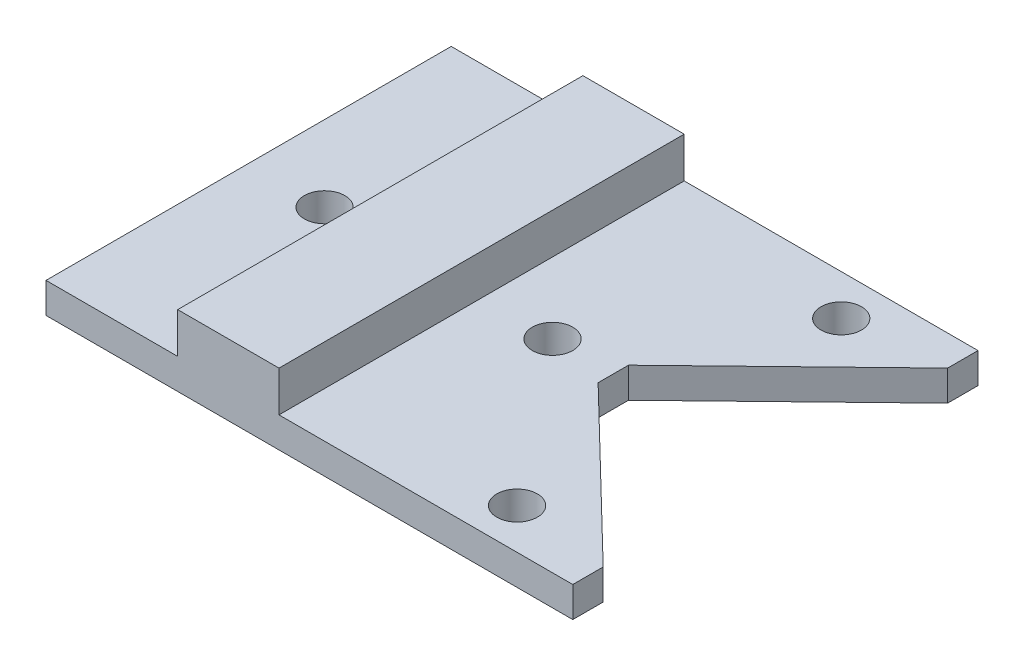
ISO-10303-21;
HEADER;
FILE_DESCRIPTION(('STEP AP214'),'2;1');
FILE_NAME('part.step','',(''),(''),'','','');
FILE_SCHEMA(('AUTOMOTIVE_DESIGN { 1 0 10303 214 1 1 1 1 }'));
ENDSEC;
DATA;
#1=APPLICATION_CONTEXT('core data for automotive mechanical design processes');
#2=APPLICATION_PROTOCOL_DEFINITION('international standard','automotive_design',2000,#1);
#3=PRODUCT_CONTEXT('',#1,'mechanical');
#4=PRODUCT('Part','Part','',(#3));
#5=PRODUCT_RELATED_PRODUCT_CATEGORY('part','',(#4));
#6=PRODUCT_DEFINITION_FORMATION('','',#4);
#7=PRODUCT_DEFINITION_CONTEXT('part definition',#1,'design');
#8=PRODUCT_DEFINITION('design','',#6,#7);
#9=PRODUCT_DEFINITION_SHAPE('','',#8);
#10=(LENGTH_UNIT() NAMED_UNIT(*) SI_UNIT(.MILLI.,.METRE.));
#11=(NAMED_UNIT(*) PLANE_ANGLE_UNIT() SI_UNIT($,.RADIAN.));
#12=(NAMED_UNIT(*) SI_UNIT($,.STERADIAN.) SOLID_ANGLE_UNIT());
#13=UNCERTAINTY_MEASURE_WITH_UNIT(LENGTH_MEASURE(1.E-05),#10,'distance_accuracy_value','');
#14=(GEOMETRIC_REPRESENTATION_CONTEXT(3) GLOBAL_UNCERTAINTY_ASSIGNED_CONTEXT((#13)) GLOBAL_UNIT_ASSIGNED_CONTEXT((#10,
#11,#12)) REPRESENTATION_CONTEXT('',''));
#15=CARTESIAN_POINT('',(0.,0.,0.));
#16=DIRECTION('',(0.,0.,1.));
#17=DIRECTION('',(1.,0.,0.));
#18=AXIS2_PLACEMENT_3D('',#15,#16,#17);
#19=CARTESIAN_POINT('',(0.,3.,0.));
#20=DIRECTION('',(0.,1.,0.));
#21=DIRECTION('',(0.,0.,1.));
#22=AXIS2_PLACEMENT_3D('',#19,#20,#21);
#23=PLANE('',#22);
#24=CARTESIAN_POINT('',(4.,3.,0.));
#25=DIRECTION('',(0.,1.,0.));
#26=DIRECTION('',(0.,0.,1.));
#27=AXIS2_PLACEMENT_3D('',#24,#25,#26);
#28=CIRCLE('',#27,2.);
#29=CARTESIAN_POINT('',(4.,3.,2.));
#30=VERTEX_POINT('',#29);
#31=EDGE_CURVE('E252',#30,#30,#28,.T.);
#32=ORIENTED_EDGE('',*,*,#31,.F.);
#33=EDGE_LOOP('',(#32));
#34=FACE_BOUND('',#33,.T.);
#35=CARTESIAN_POINT('',(16.5,3.,-16.));
#36=DIRECTION('',(0.,1.,0.));
#37=DIRECTION('',(0.,0.,1.));
#38=AXIS2_PLACEMENT_3D('',#35,#36,#37);
#39=CIRCLE('',#38,2.);
#40=CARTESIAN_POINT('',(16.5,3.,-14.));
#41=VERTEX_POINT('',#40);
#42=EDGE_CURVE('E248',#41,#41,#39,.T.);
#43=ORIENTED_EDGE('',*,*,#42,.F.);
#44=EDGE_LOOP('',(#43));
#45=FACE_BOUND('',#44,.T.);
#46=CARTESIAN_POINT('',(16.5,3.,16.));
#47=DIRECTION('',(0.,1.,0.));
#48=DIRECTION('',(0.,0.,1.));
#49=AXIS2_PLACEMENT_3D('',#46,#47,#48);
#50=CIRCLE('',#49,2.);
#51=CARTESIAN_POINT('',(16.5,3.,18.));
#52=VERTEX_POINT('',#51);
#53=EDGE_CURVE('E244',#52,#52,#50,.T.);
#54=ORIENTED_EDGE('',*,*,#53,.F.);
#55=EDGE_LOOP('',(#54));
#56=FACE_BOUND('',#55,.T.);
#57=DIRECTION('',(0.,0.,-1.));
#58=VECTOR('',#57,1.);
#59=CARTESIAN_POINT('',(-3.,3.,20.));
#60=LINE('',#59,#58);
#61=CARTESIAN_POINT('',(-3.,3.,20.));
#62=VERTEX_POINT('',#61);
#63=CARTESIAN_POINT('',(-3.,3.,-20.));
#64=VERTEX_POINT('',#63);
#65=EDGE_CURVE('E154',#62,#64,#60,.T.);
#66=ORIENTED_EDGE('',*,*,#65,.F.);
#67=DIRECTION('',(1.,0.,0.));
#68=VECTOR('',#67,1.);
#69=CARTESIAN_POINT('',(26.,3.,20.));
#70=LINE('',#69,#68);
#71=CARTESIAN_POINT('',(26.,3.,20.));
#72=VERTEX_POINT('',#71);
#73=EDGE_CURVE('E171',#62,#72,#70,.T.);
#74=ORIENTED_EDGE('',*,*,#73,.T.);
#75=DIRECTION('',(0.,0.,-1.));
#76=VECTOR('',#75,1.);
#77=CARTESIAN_POINT('',(26.,3.,20.));
#78=LINE('',#77,#76);
#79=CARTESIAN_POINT('',(26.,3.,17.));
#80=VERTEX_POINT('',#79);
#81=EDGE_CURVE('E176',#72,#80,#78,.T.);
#82=ORIENTED_EDGE('',*,*,#81,.T.);
#83=DIRECTION('',(-0.718240222789173,0.,-0.695795215827012));
#84=VECTOR('',#83,1.);
#85=CARTESIAN_POINT('',(10.,3.,1.5));
#86=LINE('',#85,#84);
#87=CARTESIAN_POINT('',(10.,3.,1.5));
#88=VERTEX_POINT('',#87);
#89=EDGE_CURVE('E179',#80,#88,#86,.T.);
#90=ORIENTED_EDGE('',*,*,#89,.T.);
#91=DIRECTION('',(0.,0.,-1.));
#92=VECTOR('',#91,1.);
#93=CARTESIAN_POINT('',(10.,3.,1.5));
#94=LINE('',#93,#92);
#95=CARTESIAN_POINT('',(10.,3.,-1.5));
#96=VERTEX_POINT('',#95);
#97=EDGE_CURVE('E182',#88,#96,#94,.T.);
#98=ORIENTED_EDGE('',*,*,#97,.T.);
#99=DIRECTION('',(0.718240222789174,0.,-0.695795215827012));
#100=VECTOR('',#99,1.);
#101=CARTESIAN_POINT('',(26.,3.,-17.));
#102=LINE('',#101,#100);
#103=CARTESIAN_POINT('',(26.,3.,-17.));
#104=VERTEX_POINT('',#103);
#105=EDGE_CURVE('E185',#96,#104,#102,.T.);
#106=ORIENTED_EDGE('',*,*,#105,.T.);
#107=DIRECTION('',(0.,0.,-1.));
#108=VECTOR('',#107,1.);
#109=CARTESIAN_POINT('',(26.,3.,-20.));
#110=LINE('',#109,#108);
#111=CARTESIAN_POINT('',(26.,3.,-20.));
#112=VERTEX_POINT('',#111);
#113=EDGE_CURVE('E188',#104,#112,#110,.T.);
#114=ORIENTED_EDGE('',*,*,#113,.T.);
#115=DIRECTION('',(-1.,0.,0.));
#116=VECTOR('',#115,1.);
#117=CARTESIAN_POINT('',(26.,3.,-20.));
#118=LINE('',#117,#116);
#119=EDGE_CURVE('E65',#112,#64,#118,.T.);
#120=ORIENTED_EDGE('',*,*,#119,.T.);
#121=EDGE_LOOP('',(#66,#74,#82,#90,#98,#106,#114,#120));
#122=FACE_BOUND('',#121,.T.);
#123=ADVANCED_FACE('F39',(#34,#45,#56,#122),#23,.T.);
#124=CARTESIAN_POINT('',(-26.,3.,20.));
#125=DIRECTION('',(1.,0.,0.));
#126=DIRECTION('',(0.,0.,-1.));
#127=AXIS2_PLACEMENT_3D('',#124,#125,#126);
#128=PLANE('',#127);
#129=DIRECTION('',(0.,0.,1.));
#130=VECTOR('',#129,1.);
#131=CARTESIAN_POINT('',(-26.,0.,20.));
#132=LINE('',#131,#130);
#133=CARTESIAN_POINT('',(-26.,0.,-20.));
#134=VERTEX_POINT('',#133);
#135=CARTESIAN_POINT('',(-26.,0.,20.));
#136=VERTEX_POINT('',#135);
#137=EDGE_CURVE('E156',#134,#136,#132,.T.);
#138=ORIENTED_EDGE('',*,*,#137,.T.);
#139=DIRECTION('',(0.,-1.,0.));
#140=VECTOR('',#139,1.);
#141=CARTESIAN_POINT('',(-26.,3.,20.));
#142=LINE('',#141,#140);
#143=CARTESIAN_POINT('',(-26.,3.,20.));
#144=VERTEX_POINT('',#143);
#145=EDGE_CURVE('E11',#144,#136,#142,.T.);
#146=ORIENTED_EDGE('',*,*,#145,.F.);
#147=DIRECTION('',(0.,0.,1.));
#148=VECTOR('',#147,1.);
#149=CARTESIAN_POINT('',(-26.,3.,20.));
#150=LINE('',#149,#148);
#151=CARTESIAN_POINT('',(-26.,3.,-20.));
#152=VERTEX_POINT('',#151);
#153=EDGE_CURVE('E167',#152,#144,#150,.T.);
#154=ORIENTED_EDGE('',*,*,#153,.F.);
#155=DIRECTION('',(0.,-1.,0.));
#156=VECTOR('',#155,1.);
#157=CARTESIAN_POINT('',(-26.,3.,-20.));
#158=LINE('',#157,#156);
#159=EDGE_CURVE('E193',#152,#134,#158,.T.);
#160=ORIENTED_EDGE('',*,*,#159,.T.);
#161=EDGE_LOOP('',(#138,#146,#154,#160));
#162=FACE_BOUND('',#161,.T.);
#163=ADVANCED_FACE('F41',(#162),#128,.F.);
#164=CARTESIAN_POINT('',(26.,3.,20.));
#165=DIRECTION('',(0.,0.,-1.));
#166=DIRECTION('',(-1.,0.,0.));
#167=AXIS2_PLACEMENT_3D('',#164,#165,#166);
#168=PLANE('',#167);
#169=DIRECTION('',(1.,0.,0.));
#170=VECTOR('',#169,1.);
#171=CARTESIAN_POINT('',(26.,0.,20.));
#172=LINE('',#171,#170);
#173=CARTESIAN_POINT('',(26.,0.,20.));
#174=VERTEX_POINT('',#173);
#175=EDGE_CURVE('E161',#136,#174,#172,.T.);
#176=ORIENTED_EDGE('',*,*,#175,.T.);
#177=DIRECTION('',(0.,-1.,0.));
#178=VECTOR('',#177,1.);
#179=CARTESIAN_POINT('',(26.,3.,20.));
#180=LINE('',#179,#178);
#181=EDGE_CURVE('E49',#72,#174,#180,.T.);
#182=ORIENTED_EDGE('',*,*,#181,.F.);
#183=ORIENTED_EDGE('',*,*,#73,.F.);
#184=DIRECTION('',(0.,-1.,0.));
#185=VECTOR('',#184,1.);
#186=CARTESIAN_POINT('',(-3.,7.,20.));
#187=LINE('',#186,#185);
#188=CARTESIAN_POINT('',(-3.,7.,20.));
#189=VERTEX_POINT('',#188);
#190=EDGE_CURVE('E273',#189,#62,#187,.T.);
#191=ORIENTED_EDGE('',*,*,#190,.F.);
#192=DIRECTION('',(1.,0.,0.));
#193=VECTOR('',#192,1.);
#194=CARTESIAN_POINT('',(-3.,7.,20.));
#195=LINE('',#194,#193);
#196=CARTESIAN_POINT('',(-13.,7.,20.));
#197=VERTEX_POINT('',#196);
#198=EDGE_CURVE('E147',#197,#189,#195,.T.);
#199=ORIENTED_EDGE('',*,*,#198,.F.);
#200=DIRECTION('',(0.,-1.,0.));
#201=VECTOR('',#200,1.);
#202=CARTESIAN_POINT('',(-13.,7.,20.));
#203=LINE('',#202,#201);
#204=CARTESIAN_POINT('',(-13.,3.,20.));
#205=VERTEX_POINT('',#204);
#206=EDGE_CURVE('E163',#197,#205,#203,.T.);
#207=ORIENTED_EDGE('',*,*,#206,.T.);
#208=EDGE_CURVE('E173',#144,#205,#70,.T.);
#209=ORIENTED_EDGE('',*,*,#208,.F.);
#210=ORIENTED_EDGE('',*,*,#145,.T.);
#211=EDGE_LOOP('',(#176,#182,#183,#191,#199,#207,#209,#210));
#212=FACE_BOUND('',#211,.T.);
#213=ADVANCED_FACE('F283',(#212),#168,.F.);
#214=CARTESIAN_POINT('',(26.,3.,20.));
#215=DIRECTION('',(-1.,0.,0.));
#216=DIRECTION('',(0.,0.,1.));
#217=AXIS2_PLACEMENT_3D('',#214,#215,#216);
#218=PLANE('',#217);
#219=DIRECTION('',(0.,0.,-1.));
#220=VECTOR('',#219,1.);
#221=CARTESIAN_POINT('',(26.,0.,20.));
#222=LINE('',#221,#220);
#223=CARTESIAN_POINT('',(26.,0.,17.));
#224=VERTEX_POINT('',#223);
#225=EDGE_CURVE('E197',#174,#224,#222,.T.);
#226=ORIENTED_EDGE('',*,*,#225,.T.);
#227=DIRECTION('',(0.,-1.,0.));
#228=VECTOR('',#227,1.);
#229=CARTESIAN_POINT('',(26.,3.,17.));
#230=LINE('',#229,#228);
#231=EDGE_CURVE('E233',#80,#224,#230,.T.);
#232=ORIENTED_EDGE('',*,*,#231,.F.);
#233=ORIENTED_EDGE('',*,*,#81,.F.);
#234=ORIENTED_EDGE('',*,*,#181,.T.);
#235=EDGE_LOOP('',(#226,#232,#233,#234));
#236=FACE_BOUND('',#235,.T.);
#237=ADVANCED_FACE('F358',(#236),#218,.F.);
#238=CARTESIAN_POINT('',(10.,3.,1.5));
#239=DIRECTION('',(-0.695795215827012,0.,0.718240222789174));
#240=DIRECTION('',(0.718240222789174,0.,0.695795215827012));
#241=AXIS2_PLACEMENT_3D('',#238,#239,#240);
#242=PLANE('',#241);
#243=DIRECTION('',(-0.718240222789173,0.,-0.695795215827012));
#244=VECTOR('',#243,1.);
#245=CARTESIAN_POINT('',(10.,0.,1.5));
#246=LINE('',#245,#244);
#247=CARTESIAN_POINT('',(10.,0.,1.5));
#248=VERTEX_POINT('',#247);
#249=EDGE_CURVE('E200',#224,#248,#246,.T.);
#250=ORIENTED_EDGE('',*,*,#249,.T.);
#251=DIRECTION('',(0.,-1.,0.));
#252=VECTOR('',#251,1.);
#253=CARTESIAN_POINT('',(10.,3.,1.5));
#254=LINE('',#253,#252);
#255=EDGE_CURVE('E229',#88,#248,#254,.T.);
#256=ORIENTED_EDGE('',*,*,#255,.F.);
#257=ORIENTED_EDGE('',*,*,#89,.F.);
#258=ORIENTED_EDGE('',*,*,#231,.T.);
#259=EDGE_LOOP('',(#250,#256,#257,#258));
#260=FACE_BOUND('',#259,.T.);
#261=ADVANCED_FACE('F355',(#260),#242,.F.);
#262=CARTESIAN_POINT('',(10.,3.,1.5));
#263=DIRECTION('',(-1.,0.,0.));
#264=DIRECTION('',(0.,0.,1.));
#265=AXIS2_PLACEMENT_3D('',#262,#263,#264);
#266=PLANE('',#265);
#267=DIRECTION('',(0.,0.,-1.));
#268=VECTOR('',#267,1.);
#269=CARTESIAN_POINT('',(10.,0.,1.5));
#270=LINE('',#269,#268);
#271=CARTESIAN_POINT('',(10.,0.,-1.5));
#272=VERTEX_POINT('',#271);
#273=EDGE_CURVE('E203',#248,#272,#270,.T.);
#274=ORIENTED_EDGE('',*,*,#273,.T.);
#275=DIRECTION('',(0.,-1.,0.));
#276=VECTOR('',#275,1.);
#277=CARTESIAN_POINT('',(10.,3.,-1.5));
#278=LINE('',#277,#276);
#279=EDGE_CURVE('E225',#96,#272,#278,.T.);
#280=ORIENTED_EDGE('',*,*,#279,.F.);
#281=ORIENTED_EDGE('',*,*,#97,.F.);
#282=ORIENTED_EDGE('',*,*,#255,.T.);
#283=EDGE_LOOP('',(#274,#280,#281,#282));
#284=FACE_BOUND('',#283,.T.);
#285=ADVANCED_FACE('F351',(#284),#266,.F.);
#286=CARTESIAN_POINT('',(26.,3.,-17.));
#287=DIRECTION('',(-0.695795215827012,0.,-0.718240222789174));
#288=DIRECTION('',(-0.718240222789174,0.,0.695795215827012));
#289=AXIS2_PLACEMENT_3D('',#286,#287,#288);
#290=PLANE('',#289);
#291=DIRECTION('',(0.718240222789174,0.,-0.695795215827012));
#292=VECTOR('',#291,1.);
#293=CARTESIAN_POINT('',(26.,0.,-17.));
#294=LINE('',#293,#292);
#295=CARTESIAN_POINT('',(26.,0.,-17.));
#296=VERTEX_POINT('',#295);
#297=EDGE_CURVE('E206',#272,#296,#294,.T.);
#298=ORIENTED_EDGE('',*,*,#297,.T.);
#299=DIRECTION('',(0.,-1.,0.));
#300=VECTOR('',#299,1.);
#301=CARTESIAN_POINT('',(26.,3.,-17.));
#302=LINE('',#301,#300);
#303=EDGE_CURVE('E221',#104,#296,#302,.T.);
#304=ORIENTED_EDGE('',*,*,#303,.F.);
#305=ORIENTED_EDGE('',*,*,#105,.F.);
#306=ORIENTED_EDGE('',*,*,#279,.T.);
#307=EDGE_LOOP('',(#298,#304,#305,#306));
#308=FACE_BOUND('',#307,.T.);
#309=ADVANCED_FACE('F346',(#308),#290,.F.);
#310=CARTESIAN_POINT('',(26.,3.,-20.));
#311=DIRECTION('',(-1.,0.,0.));
#312=DIRECTION('',(0.,0.,1.));
#313=AXIS2_PLACEMENT_3D('',#310,#311,#312);
#314=PLANE('',#313);
#315=DIRECTION('',(0.,0.,-1.));
#316=VECTOR('',#315,1.);
#317=CARTESIAN_POINT('',(26.,0.,-20.));
#318=LINE('',#317,#316);
#319=CARTESIAN_POINT('',(26.,0.,-20.));
#320=VERTEX_POINT('',#319);
#321=EDGE_CURVE('E209',#296,#320,#318,.T.);
#322=ORIENTED_EDGE('',*,*,#321,.T.);
#323=DIRECTION('',(0.,-1.,0.));
#324=VECTOR('',#323,1.);
#325=CARTESIAN_POINT('',(26.,3.,-20.));
#326=LINE('',#325,#324);
#327=EDGE_CURVE('E217',#112,#320,#326,.T.);
#328=ORIENTED_EDGE('',*,*,#327,.F.);
#329=ORIENTED_EDGE('',*,*,#113,.F.);
#330=ORIENTED_EDGE('',*,*,#303,.T.);
#331=EDGE_LOOP('',(#322,#328,#329,#330));
#332=FACE_BOUND('',#331,.T.);
#333=ADVANCED_FACE('F314',(#332),#314,.F.);
#334=CARTESIAN_POINT('',(26.,3.,-20.));
#335=DIRECTION('',(0.,0.,1.));
#336=DIRECTION('',(1.,0.,0.));
#337=AXIS2_PLACEMENT_3D('',#334,#335,#336);
#338=PLANE('',#337);
#339=DIRECTION('',(-1.,0.,0.));
#340=VECTOR('',#339,1.);
#341=CARTESIAN_POINT('',(26.,0.,-20.));
#342=LINE('',#341,#340);
#343=EDGE_CURVE('E172',#320,#134,#342,.T.);
#344=ORIENTED_EDGE('',*,*,#343,.T.);
#345=ORIENTED_EDGE('',*,*,#159,.F.);
#346=CARTESIAN_POINT('',(-13.,3.,-20.));
#347=VERTEX_POINT('',#346);
#348=EDGE_CURVE('E191',#347,#152,#118,.T.);
#349=ORIENTED_EDGE('',*,*,#348,.F.);
#350=DIRECTION('',(0.,-1.,0.));
#351=VECTOR('',#350,1.);
#352=CARTESIAN_POINT('',(-13.,7.,-20.));
#353=LINE('',#352,#351);
#354=CARTESIAN_POINT('',(-13.,7.,-20.));
#355=VERTEX_POINT('',#354);
#356=EDGE_CURVE('E137',#355,#347,#353,.T.);
#357=ORIENTED_EDGE('',*,*,#356,.F.);
#358=DIRECTION('',(-1.,0.,0.));
#359=VECTOR('',#358,1.);
#360=CARTESIAN_POINT('',(-2.99999999999999,7.,-20.));
#361=LINE('',#360,#359);
#362=CARTESIAN_POINT('',(-2.99999999999999,7.,-20.));
#363=VERTEX_POINT('',#362);
#364=EDGE_CURVE('E130',#363,#355,#361,.T.);
#365=ORIENTED_EDGE('',*,*,#364,.F.);
#366=DIRECTION('',(0.,-1.,0.));
#367=VECTOR('',#366,1.);
#368=CARTESIAN_POINT('',(-2.99999999999999,7.,-20.));
#369=LINE('',#368,#367);
#370=EDGE_CURVE('E134',#363,#64,#369,.T.);
#371=ORIENTED_EDGE('',*,*,#370,.T.);
#372=ORIENTED_EDGE('',*,*,#119,.F.);
#373=ORIENTED_EDGE('',*,*,#327,.T.);
#374=EDGE_LOOP('',(#344,#345,#349,#357,#365,#371,#372,#373));
#375=FACE_BOUND('',#374,.T.);
#376=ADVANCED_FACE('F132',(#375),#338,.F.);
#377=CARTESIAN_POINT('',(-18.5,3.,0.));
#378=DIRECTION('',(0.,1.,0.));
#379=DIRECTION('',(0.,0.,1.));
#380=AXIS2_PLACEMENT_3D('',#377,#378,#379);
#381=CIRCLE('',#380,2.);
#382=CARTESIAN_POINT('',(-18.5,3.,2.));
#383=VERTEX_POINT('',#382);
#384=EDGE_CURVE('E265',#383,#383,#381,.T.);
#385=ORIENTED_EDGE('',*,*,#384,.F.);
#386=EDGE_LOOP('',(#385));
#387=FACE_BOUND('',#386,.T.);
#388=DIRECTION('',(0.,0.,1.));
#389=VECTOR('',#388,1.);
#390=CARTESIAN_POINT('',(-13.,3.,20.));
#391=LINE('',#390,#389);
#392=EDGE_CURVE('E57',#347,#205,#391,.T.);
#393=ORIENTED_EDGE('',*,*,#392,.F.);
#394=ORIENTED_EDGE('',*,*,#348,.T.);
#395=ORIENTED_EDGE('',*,*,#153,.T.);
#396=ORIENTED_EDGE('',*,*,#208,.T.);
#397=EDGE_LOOP('',(#393,#394,#395,#396));
#398=FACE_BOUND('',#397,.T.);
#399=ADVANCED_FACE('F299',(#387,#398),#23,.T.);
#400=CARTESIAN_POINT('',(0.,0.,0.));
#401=DIRECTION('',(0.,1.,0.));
#402=DIRECTION('',(0.,0.,1.));
#403=AXIS2_PLACEMENT_3D('',#400,#401,#402);
#404=PLANE('',#403);
#405=CARTESIAN_POINT('',(-18.5,0.,0.));
#406=DIRECTION('',(0.,1.,0.));
#407=DIRECTION('',(0.,0.,1.));
#408=AXIS2_PLACEMENT_3D('',#405,#406,#407);
#409=CIRCLE('',#408,2.);
#410=CARTESIAN_POINT('',(-18.5,0.,2.));
#411=VERTEX_POINT('',#410);
#412=EDGE_CURVE('E43',#411,#411,#409,.T.);
#413=ORIENTED_EDGE('',*,*,#412,.T.);
#414=EDGE_LOOP('',(#413));
#415=FACE_BOUND('',#414,.T.);
#416=CARTESIAN_POINT('',(4.,0.,0.));
#417=DIRECTION('',(0.,1.,0.));
#418=DIRECTION('',(0.,0.,1.));
#419=AXIS2_PLACEMENT_3D('',#416,#417,#418);
#420=CIRCLE('',#419,2.);
#421=CARTESIAN_POINT('',(4.,0.,2.));
#422=VERTEX_POINT('',#421);
#423=EDGE_CURVE('E249',#422,#422,#420,.T.);
#424=ORIENTED_EDGE('',*,*,#423,.T.);
#425=EDGE_LOOP('',(#424));
#426=FACE_BOUND('',#425,.T.);
#427=CARTESIAN_POINT('',(16.5,0.,-16.));
#428=DIRECTION('',(0.,1.,0.));
#429=DIRECTION('',(0.,0.,1.));
#430=AXIS2_PLACEMENT_3D('',#427,#428,#429);
#431=CIRCLE('',#430,2.);
#432=CARTESIAN_POINT('',(16.5,0.,-14.));
#433=VERTEX_POINT('',#432);
#434=EDGE_CURVE('E245',#433,#433,#431,.T.);
#435=ORIENTED_EDGE('',*,*,#434,.T.);
#436=EDGE_LOOP('',(#435));
#437=FACE_BOUND('',#436,.T.);
#438=CARTESIAN_POINT('',(16.5,0.,16.));
#439=DIRECTION('',(0.,1.,0.));
#440=DIRECTION('',(0.,0.,1.));
#441=AXIS2_PLACEMENT_3D('',#438,#439,#440);
#442=CIRCLE('',#441,2.);
#443=CARTESIAN_POINT('',(16.5,0.,18.));
#444=VERTEX_POINT('',#443);
#445=EDGE_CURVE('E240',#444,#444,#442,.T.);
#446=ORIENTED_EDGE('',*,*,#445,.T.);
#447=EDGE_LOOP('',(#446));
#448=FACE_BOUND('',#447,.T.);
#449=ORIENTED_EDGE('',*,*,#137,.F.);
#450=ORIENTED_EDGE('',*,*,#343,.F.);
#451=ORIENTED_EDGE('',*,*,#321,.F.);
#452=ORIENTED_EDGE('',*,*,#297,.F.);
#453=ORIENTED_EDGE('',*,*,#273,.F.);
#454=ORIENTED_EDGE('',*,*,#249,.F.);
#455=ORIENTED_EDGE('',*,*,#225,.F.);
#456=ORIENTED_EDGE('',*,*,#175,.F.);
#457=EDGE_LOOP('',(#449,#450,#451,#452,#453,#454,#455,#456));
#458=FACE_BOUND('',#457,.T.);
#459=ADVANCED_FACE('F294',(#415,#426,#437,#448,#458),#404,.F.);
#460=CARTESIAN_POINT('',(-3.,7.,20.));
#461=DIRECTION('',(-1.,0.,0.));
#462=DIRECTION('',(0.,0.,1.));
#463=AXIS2_PLACEMENT_3D('',#460,#461,#462);
#464=PLANE('',#463);
#465=ORIENTED_EDGE('',*,*,#65,.T.);
#466=ORIENTED_EDGE('',*,*,#370,.F.);
#467=DIRECTION('',(0.,0.,-1.));
#468=VECTOR('',#467,1.);
#469=CARTESIAN_POINT('',(-3.,7.,20.));
#470=LINE('',#469,#468);
#471=EDGE_CURVE('E142',#189,#363,#470,.T.);
#472=ORIENTED_EDGE('',*,*,#471,.F.);
#473=ORIENTED_EDGE('',*,*,#190,.T.);
#474=EDGE_LOOP('',(#465,#466,#472,#473));
#475=FACE_BOUND('',#474,.T.);
#476=ADVANCED_FACE('F153',(#475),#464,.F.);
#477=CARTESIAN_POINT('',(-13.,7.,20.));
#478=DIRECTION('',(1.,0.,0.));
#479=DIRECTION('',(0.,0.,-1.));
#480=AXIS2_PLACEMENT_3D('',#477,#478,#479);
#481=PLANE('',#480);
#482=ORIENTED_EDGE('',*,*,#392,.T.);
#483=ORIENTED_EDGE('',*,*,#206,.F.);
#484=DIRECTION('',(0.,0.,1.));
#485=VECTOR('',#484,1.);
#486=CARTESIAN_POINT('',(-13.,7.,20.));
#487=LINE('',#486,#485);
#488=EDGE_CURVE('E141',#355,#197,#487,.T.);
#489=ORIENTED_EDGE('',*,*,#488,.F.);
#490=ORIENTED_EDGE('',*,*,#356,.T.);
#491=EDGE_LOOP('',(#482,#483,#489,#490));
#492=FACE_BOUND('',#491,.T.);
#493=ADVANCED_FACE('F285',(#492),#481,.F.);
#494=CARTESIAN_POINT('',(0.,7.,0.));
#495=DIRECTION('',(0.,1.,0.));
#496=DIRECTION('',(0.,0.,1.));
#497=AXIS2_PLACEMENT_3D('',#494,#495,#496);
#498=PLANE('',#497);
#499=ORIENTED_EDGE('',*,*,#471,.T.);
#500=ORIENTED_EDGE('',*,*,#364,.T.);
#501=ORIENTED_EDGE('',*,*,#488,.T.);
#502=ORIENTED_EDGE('',*,*,#198,.T.);
#503=EDGE_LOOP('',(#499,#500,#501,#502));
#504=FACE_BOUND('',#503,.T.);
#505=ADVANCED_FACE('F145',(#504),#498,.T.);
#506=CARTESIAN_POINT('',(16.5,7.,16.));
#507=DIRECTION('',(0.,-1.,0.));
#508=DIRECTION('',(0.,0.,-1.));
#509=AXIS2_PLACEMENT_3D('',#506,#507,#508);
#510=CYLINDRICAL_SURFACE('',#509,2.);
#511=ORIENTED_EDGE('',*,*,#53,.T.);
#512=EDGE_LOOP('',(#511));
#513=FACE_BOUND('',#512,.T.);
#514=ORIENTED_EDGE('',*,*,#445,.F.);
#515=EDGE_LOOP('',(#514));
#516=FACE_BOUND('',#515,.T.);
#517=ADVANCED_FACE('F292',(#513,#516),#510,.F.);
#518=CARTESIAN_POINT('',(16.5,7.,-16.));
#519=DIRECTION('',(0.,-1.,0.));
#520=DIRECTION('',(0.,0.,-1.));
#521=AXIS2_PLACEMENT_3D('',#518,#519,#520);
#522=CYLINDRICAL_SURFACE('',#521,2.);
#523=ORIENTED_EDGE('',*,*,#42,.T.);
#524=EDGE_LOOP('',(#523));
#525=FACE_BOUND('',#524,.T.);
#526=ORIENTED_EDGE('',*,*,#434,.F.);
#527=EDGE_LOOP('',(#526));
#528=FACE_BOUND('',#527,.T.);
#529=ADVANCED_FACE('F428',(#525,#528),#522,.F.);
#530=CARTESIAN_POINT('',(4.,7.,0.));
#531=DIRECTION('',(0.,-1.,0.));
#532=DIRECTION('',(0.,0.,-1.));
#533=AXIS2_PLACEMENT_3D('',#530,#531,#532);
#534=CYLINDRICAL_SURFACE('',#533,2.);
#535=ORIENTED_EDGE('',*,*,#31,.T.);
#536=EDGE_LOOP('',(#535));
#537=FACE_BOUND('',#536,.T.);
#538=ORIENTED_EDGE('',*,*,#423,.F.);
#539=EDGE_LOOP('',(#538));
#540=FACE_BOUND('',#539,.T.);
#541=ADVANCED_FACE('F321',(#537,#540),#534,.F.);
#542=CARTESIAN_POINT('',(-18.5,7.,0.));
#543=DIRECTION('',(0.,-1.,0.));
#544=DIRECTION('',(0.,0.,-1.));
#545=AXIS2_PLACEMENT_3D('',#542,#543,#544);
#546=CYLINDRICAL_SURFACE('',#545,2.);
#547=ORIENTED_EDGE('',*,*,#384,.T.);
#548=EDGE_LOOP('',(#547));
#549=FACE_BOUND('',#548,.T.);
#550=ORIENTED_EDGE('',*,*,#412,.F.);
#551=EDGE_LOOP('',(#550));
#552=FACE_BOUND('',#551,.T.);
#553=ADVANCED_FACE('F318',(#549,#552),#546,.F.);
#554=CLOSED_SHELL('',(#123,#163,#213,#237,#261,#285,#309,#333,#376,#399,#459,#476,#493,#505,
#517,#529,#541,#553));
#555=MANIFOLD_SOLID_BREP('B2',#554);
#556=ADVANCED_BREP_SHAPE_REPRESENTATION('',(#18,#555),#14);
#557=SHAPE_DEFINITION_REPRESENTATION(#9,#556);
ENDSEC;
END-ISO-10303-21;
